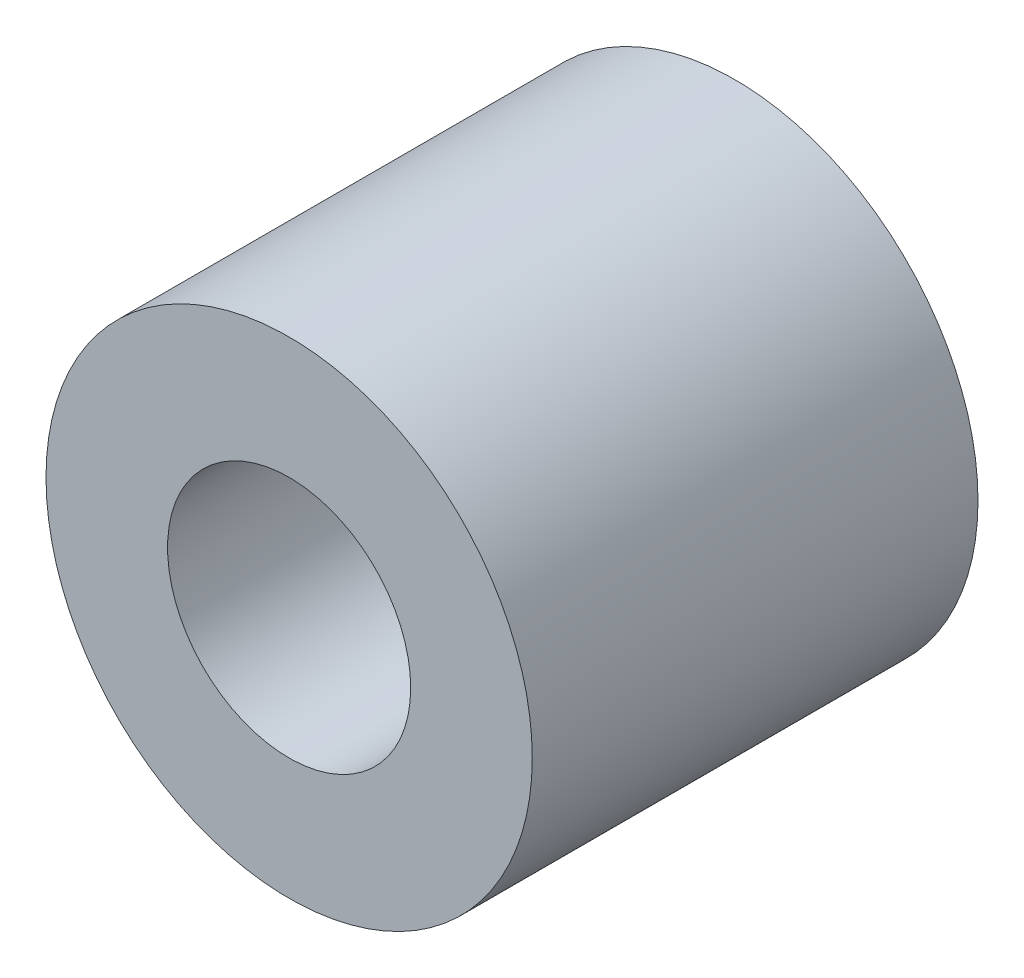
ISO-10303-21;
HEADER;
FILE_DESCRIPTION(('STEP AP214'),'2;1');
FILE_NAME('part.step','',(''),(''),'','','');
FILE_SCHEMA(('AUTOMOTIVE_DESIGN { 1 0 10303 214 1 1 1 1 }'));
ENDSEC;
DATA;
#1=APPLICATION_CONTEXT('core data for automotive mechanical design processes');
#2=APPLICATION_PROTOCOL_DEFINITION('international standard','automotive_design',2000,#1);
#3=PRODUCT_CONTEXT('',#1,'mechanical');
#4=PRODUCT('Part','Part','',(#3));
#5=PRODUCT_RELATED_PRODUCT_CATEGORY('part','',(#4));
#6=PRODUCT_DEFINITION_FORMATION('','',#4);
#7=PRODUCT_DEFINITION_CONTEXT('part definition',#1,'design');
#8=PRODUCT_DEFINITION('design','',#6,#7);
#9=PRODUCT_DEFINITION_SHAPE('','',#8);
#10=(LENGTH_UNIT() NAMED_UNIT(*) SI_UNIT(.MILLI.,.METRE.));
#11=(NAMED_UNIT(*) PLANE_ANGLE_UNIT() SI_UNIT($,.RADIAN.));
#12=(NAMED_UNIT(*) SI_UNIT($,.STERADIAN.) SOLID_ANGLE_UNIT());
#13=UNCERTAINTY_MEASURE_WITH_UNIT(LENGTH_MEASURE(1.E-05),#10,'distance_accuracy_value','');
#14=(GEOMETRIC_REPRESENTATION_CONTEXT(3) GLOBAL_UNCERTAINTY_ASSIGNED_CONTEXT((#13)) GLOBAL_UNIT_ASSIGNED_CONTEXT((#10,
#11,#12)) REPRESENTATION_CONTEXT('',''));
#15=CARTESIAN_POINT('',(0.,0.,0.));
#16=DIRECTION('',(0.,0.,1.));
#17=DIRECTION('',(1.,0.,0.));
#18=AXIS2_PLACEMENT_3D('',#15,#16,#17);
#19=CARTESIAN_POINT('',(0.,0.,5.5));
#20=DIRECTION('',(0.,0.,1.));
#21=DIRECTION('',(1.,0.,0.));
#22=AXIS2_PLACEMENT_3D('',#19,#20,#21);
#23=PLANE('',#22);
#24=CARTESIAN_POINT('',(0.,0.,5.5));
#25=DIRECTION('',(0.,0.,1.));
#26=DIRECTION('',(1.,0.,0.));
#27=AXIS2_PLACEMENT_3D('',#24,#25,#26);
#28=CIRCLE('',#27,3.);
#29=CARTESIAN_POINT('',(3.00000000000001,0.,5.5));
#30=VERTEX_POINT('',#29);
#31=EDGE_CURVE('E10',#30,#30,#28,.T.);
#32=ORIENTED_EDGE('',*,*,#31,.T.);
#33=EDGE_LOOP('',(#32));
#34=FACE_BOUND('',#33,.T.);
#35=CARTESIAN_POINT('',(0.,0.,5.5));
#36=DIRECTION('',(0.,0.,1.));
#37=DIRECTION('',(1.,0.,0.));
#38=AXIS2_PLACEMENT_3D('',#35,#36,#37);
#39=CIRCLE('',#38,1.5);
#40=CARTESIAN_POINT('',(1.5,0.,5.5));
#41=VERTEX_POINT('',#40);
#42=EDGE_CURVE('E39',#41,#41,#39,.T.);
#43=ORIENTED_EDGE('',*,*,#42,.F.);
#44=EDGE_LOOP('',(#43));
#45=FACE_BOUND('',#44,.T.);
#46=ADVANCED_FACE('F28',(#34,#45),#23,.T.);
#47=CARTESIAN_POINT('',(0.,0.,0.));
#48=DIRECTION('',(0.,0.,1.));
#49=DIRECTION('',(1.,0.,0.));
#50=AXIS2_PLACEMENT_3D('',#47,#48,#49);
#51=PLANE('',#50);
#52=CARTESIAN_POINT('',(0.,0.,0.));
#53=DIRECTION('',(0.,0.,1.));
#54=DIRECTION('',(1.,0.,0.));
#55=AXIS2_PLACEMENT_3D('',#52,#53,#54);
#56=CIRCLE('',#55,3.);
#57=CARTESIAN_POINT('',(3.00000000000001,0.,0.));
#58=VERTEX_POINT('',#57);
#59=EDGE_CURVE('E32',#58,#58,#56,.T.);
#60=ORIENTED_EDGE('',*,*,#59,.F.);
#61=EDGE_LOOP('',(#60));
#62=FACE_BOUND('',#61,.T.);
#63=CARTESIAN_POINT('',(0.,0.,0.));
#64=DIRECTION('',(0.,0.,1.));
#65=DIRECTION('',(1.,0.,0.));
#66=AXIS2_PLACEMENT_3D('',#63,#64,#65);
#67=CIRCLE('',#66,1.5);
#68=CARTESIAN_POINT('',(1.5,0.,0.));
#69=VERTEX_POINT('',#68);
#70=EDGE_CURVE('E41',#69,#69,#67,.T.);
#71=ORIENTED_EDGE('',*,*,#70,.T.);
#72=EDGE_LOOP('',(#71));
#73=FACE_BOUND('',#72,.T.);
#74=ADVANCED_FACE('F51',(#62,#73),#51,.F.);
#75=CARTESIAN_POINT('',(0.,0.,5.5));
#76=DIRECTION('',(0.,0.,-1.));
#77=DIRECTION('',(-1.,0.,0.));
#78=AXIS2_PLACEMENT_3D('',#75,#76,#77);
#79=CYLINDRICAL_SURFACE('',#78,3.);
#80=ORIENTED_EDGE('',*,*,#31,.F.);
#81=EDGE_LOOP('',(#80));
#82=FACE_BOUND('',#81,.T.);
#83=ORIENTED_EDGE('',*,*,#59,.T.);
#84=EDGE_LOOP('',(#83));
#85=FACE_BOUND('',#84,.T.);
#86=ADVANCED_FACE('F30',(#82,#85),#79,.T.);
#87=CARTESIAN_POINT('',(0.,0.,5.5));
#88=DIRECTION('',(0.,0.,-1.));
#89=DIRECTION('',(-1.,0.,0.));
#90=AXIS2_PLACEMENT_3D('',#87,#88,#89);
#91=CYLINDRICAL_SURFACE('',#90,1.5);
#92=ORIENTED_EDGE('',*,*,#42,.T.);
#93=EDGE_LOOP('',(#92));
#94=FACE_BOUND('',#93,.T.);
#95=ORIENTED_EDGE('',*,*,#70,.F.);
#96=EDGE_LOOP('',(#95));
#97=FACE_BOUND('',#96,.T.);
#98=ADVANCED_FACE('F47',(#94,#97),#91,.F.);
#99=CLOSED_SHELL('',(#46,#74,#86,#98));
#100=MANIFOLD_SOLID_BREP('B2',#99);
#101=ADVANCED_BREP_SHAPE_REPRESENTATION('',(#18,#100),#14);
#102=SHAPE_DEFINITION_REPRESENTATION(#9,#101);
ENDSEC;
END-ISO-10303-21;
